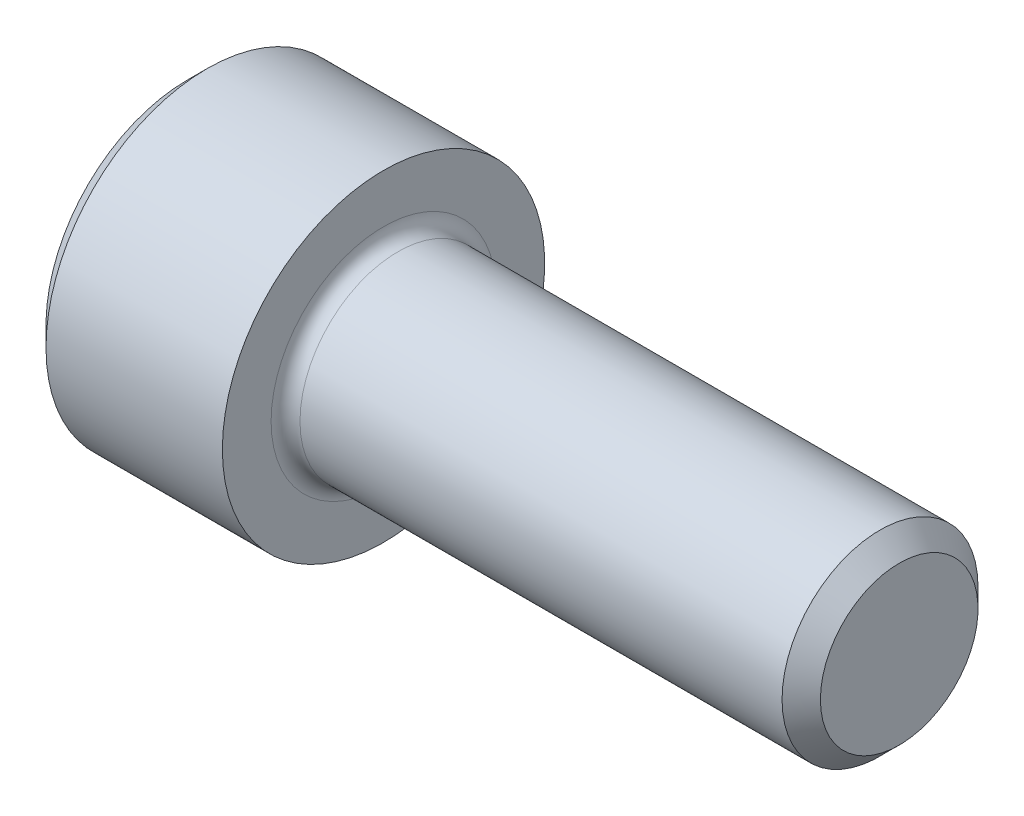
ISO-10303-21;
HEADER;
FILE_DESCRIPTION(('STEP AP214'),'2;1');
FILE_NAME('part.step','',(''),(''),'','','');
FILE_SCHEMA(('AUTOMOTIVE_DESIGN { 1 0 10303 214 1 1 1 1 }'));
ENDSEC;
DATA;
#1=APPLICATION_CONTEXT('core data for automotive mechanical design processes');
#2=APPLICATION_PROTOCOL_DEFINITION('international standard','automotive_design',2000,#1);
#3=PRODUCT_CONTEXT('',#1,'mechanical');
#4=PRODUCT('Part','Part','',(#3));
#5=PRODUCT_RELATED_PRODUCT_CATEGORY('part','',(#4));
#6=PRODUCT_DEFINITION_FORMATION('','',#4);
#7=PRODUCT_DEFINITION_CONTEXT('part definition',#1,'design');
#8=PRODUCT_DEFINITION('design','',#6,#7);
#9=PRODUCT_DEFINITION_SHAPE('','',#8);
#10=(LENGTH_UNIT() NAMED_UNIT(*) SI_UNIT(.MILLI.,.METRE.));
#11=(NAMED_UNIT(*) PLANE_ANGLE_UNIT() SI_UNIT($,.RADIAN.));
#12=(NAMED_UNIT(*) SI_UNIT($,.STERADIAN.) SOLID_ANGLE_UNIT());
#13=UNCERTAINTY_MEASURE_WITH_UNIT(LENGTH_MEASURE(1.E-05),#10,'distance_accuracy_value','');
#14=(GEOMETRIC_REPRESENTATION_CONTEXT(3) GLOBAL_UNCERTAINTY_ASSIGNED_CONTEXT((#13)) GLOBAL_UNIT_ASSIGNED_CONTEXT((#10,
#11,#12)) REPRESENTATION_CONTEXT('',''));
#15=CARTESIAN_POINT('',(0.,0.,0.));
#16=DIRECTION('',(0.,0.,1.));
#17=DIRECTION('',(1.,0.,0.));
#18=AXIS2_PLACEMENT_3D('',#15,#16,#17);
#19=CARTESIAN_POINT('',(2.286,1.14604605784411,1.98501));
#20=DIRECTION('',(-1.,0.,0.));
#21=DIRECTION('',(0.,0.,1.));
#22=AXIS2_PLACEMENT_3D('',#19,#20,#21);
#23=PLANE('',#22);
#24=DIRECTION('',(0.,0.500000000000001,0.866025403784438));
#25=VECTOR('',#24,1.);
#26=CARTESIAN_POINT('',(2.286,-1.71906908676614,0.992505));
#27=LINE('',#26,#25);
#28=CARTESIAN_POINT('',(2.2859999999804,-1.71906908679011,0.992505000013839));
#29=VERTEX_POINT('',#28);
#30=CARTESIAN_POINT('',(2.286,-1.14604605784409,1.98501));
#31=VERTEX_POINT('',#30);
#32=EDGE_CURVE('E98',#29,#31,#27,.T.);
#33=ORIENTED_EDGE('',*,*,#32,.T.);
#34=DIRECTION('',(0.,1.,0.));
#35=VECTOR('',#34,1.);
#36=CARTESIAN_POINT('',(2.286,1.14604605784411,1.98501));
#37=LINE('',#36,#35);
#38=CARTESIAN_POINT('',(2.28599999998701,0.,1.98501000001309));
#39=VERTEX_POINT('',#38);
#40=EDGE_CURVE('E93',#31,#39,#37,.T.);
#41=ORIENTED_EDGE('',*,*,#40,.T.);
#42=CARTESIAN_POINT('',(2.2859999999608,0.,0.));
#43=DIRECTION('',(-1.,0.,0.));
#44=DIRECTION('',(0.,0.,1.));
#45=AXIS2_PLACEMENT_3D('',#42,#43,#44);
#46=CIRCLE('',#45,1.98501000005535);
#47=EDGE_CURVE('E95',#39,#29,#46,.F.);
#48=ORIENTED_EDGE('',*,*,#47,.T.);
#49=EDGE_LOOP('',(#33,#41,#48));
#50=FACE_BOUND('',#49,.T.);
#51=ADVANCED_FACE('F14',(#50),#23,.T.);
#52=CARTESIAN_POINT('',(2.286,1.14604605784411,1.98501));
#53=DIRECTION('',(-1.,0.,0.));
#54=DIRECTION('',(0.,0.,1.));
#55=AXIS2_PLACEMENT_3D('',#52,#53,#54);
#56=PLANE('',#55);
#57=DIRECTION('',(0.,-0.499999999999998,0.86602540378444));
#58=VECTOR('',#57,1.);
#59=CARTESIAN_POINT('',(2.286,-1.71906908676615,-0.992504999999996));
#60=LINE('',#59,#58);
#61=CARTESIAN_POINT('',(2.2859999999804,-1.71906908679012,-0.992505000013836));
#62=VERTEX_POINT('',#61);
#63=CARTESIAN_POINT('',(2.286,-2.29209211568819,0.));
#64=VERTEX_POINT('',#63);
#65=EDGE_CURVE('E102',#62,#64,#60,.T.);
#66=ORIENTED_EDGE('',*,*,#65,.T.);
#67=DIRECTION('',(0.,0.500000000000001,0.866025403784438));
#68=VECTOR('',#67,1.);
#69=CARTESIAN_POINT('',(2.286,-2.29209211568819,0.));
#70=LINE('',#69,#68);
#71=EDGE_CURVE('E153',#64,#29,#70,.T.);
#72=ORIENTED_EDGE('',*,*,#71,.T.);
#73=CARTESIAN_POINT('',(2.2859999999608,0.,0.));
#74=DIRECTION('',(-1.,0.,0.));
#75=DIRECTION('',(0.,0.,1.));
#76=AXIS2_PLACEMENT_3D('',#73,#74,#75);
#77=CIRCLE('',#76,1.98501000005535);
#78=EDGE_CURVE('E114',#29,#62,#77,.F.);
#79=ORIENTED_EDGE('',*,*,#78,.T.);
#80=EDGE_LOOP('',(#66,#72,#79));
#81=FACE_BOUND('',#80,.T.);
#82=ADVANCED_FACE('F309',(#81),#56,.T.);
#83=CARTESIAN_POINT('',(2.286,1.14604605784411,1.98501));
#84=DIRECTION('',(-1.,0.,0.));
#85=DIRECTION('',(0.,0.,1.));
#86=AXIS2_PLACEMENT_3D('',#83,#84,#85);
#87=PLANE('',#86);
#88=DIRECTION('',(0.,1.,0.));
#89=VECTOR('',#88,1.);
#90=CARTESIAN_POINT('',(2.286,1.14604605784411,-1.98501));
#91=LINE('',#90,#89);
#92=CARTESIAN_POINT('',(2.28599999998701,0.,-1.98501000001309));
#93=VERTEX_POINT('',#92);
#94=CARTESIAN_POINT('',(2.286,-1.1460460578441,-1.98501));
#95=VERTEX_POINT('',#94);
#96=EDGE_CURVE('E150',#93,#95,#91,.F.);
#97=ORIENTED_EDGE('',*,*,#96,.T.);
#98=DIRECTION('',(0.,-0.499999999999999,0.866025403784439));
#99=VECTOR('',#98,1.);
#100=CARTESIAN_POINT('',(2.286,-1.1460460578441,-1.98501));
#101=LINE('',#100,#99);
#102=EDGE_CURVE('E147',#95,#62,#101,.T.);
#103=ORIENTED_EDGE('',*,*,#102,.T.);
#104=CARTESIAN_POINT('',(2.2859999999608,0.,0.));
#105=DIRECTION('',(-1.,0.,0.));
#106=DIRECTION('',(0.,0.,1.));
#107=AXIS2_PLACEMENT_3D('',#104,#105,#106);
#108=CIRCLE('',#107,1.98501000005535);
#109=EDGE_CURVE('E186',#62,#93,#108,.F.);
#110=ORIENTED_EDGE('',*,*,#109,.T.);
#111=EDGE_LOOP('',(#97,#103,#110));
#112=FACE_BOUND('',#111,.T.);
#113=ADVANCED_FACE('F306',(#112),#87,.T.);
#114=CARTESIAN_POINT('',(2.286,1.14604605784411,1.98501));
#115=DIRECTION('',(-1.,0.,0.));
#116=DIRECTION('',(0.,0.,1.));
#117=AXIS2_PLACEMENT_3D('',#114,#115,#116);
#118=PLANE('',#117);
#119=DIRECTION('',(0.,-0.500000000000001,-0.866025403784438));
#120=VECTOR('',#119,1.);
#121=CARTESIAN_POINT('',(2.286,1.71906908676615,-0.992505000000006));
#122=LINE('',#121,#120);
#123=CARTESIAN_POINT('',(2.2859999999804,1.71906908679012,-0.992505000013843));
#124=VERTEX_POINT('',#123);
#125=CARTESIAN_POINT('',(2.286,1.1460460578441,-1.98501));
#126=VERTEX_POINT('',#125);
#127=EDGE_CURVE('E144',#124,#126,#122,.T.);
#128=ORIENTED_EDGE('',*,*,#127,.T.);
#129=DIRECTION('',(0.,1.,0.));
#130=VECTOR('',#129,1.);
#131=CARTESIAN_POINT('',(2.286,1.14604605784411,-1.98501));
#132=LINE('',#131,#130);
#133=EDGE_CURVE('E141',#126,#93,#132,.F.);
#134=ORIENTED_EDGE('',*,*,#133,.T.);
#135=CARTESIAN_POINT('',(2.2859999999608,0.,0.));
#136=DIRECTION('',(-1.,0.,0.));
#137=DIRECTION('',(0.,0.,1.));
#138=AXIS2_PLACEMENT_3D('',#135,#136,#137);
#139=CIRCLE('',#138,1.98501000005535);
#140=EDGE_CURVE('E183',#93,#124,#139,.F.);
#141=ORIENTED_EDGE('',*,*,#140,.T.);
#142=EDGE_LOOP('',(#128,#134,#141));
#143=FACE_BOUND('',#142,.T.);
#144=ADVANCED_FACE('F302',(#143),#118,.T.);
#145=CARTESIAN_POINT('',(2.286,1.14604605784411,1.98501));
#146=DIRECTION('',(-1.,0.,0.));
#147=DIRECTION('',(0.,0.,1.));
#148=AXIS2_PLACEMENT_3D('',#145,#146,#147);
#149=PLANE('',#148);
#150=DIRECTION('',(0.,0.500000000000002,-0.866025403784437));
#151=VECTOR('',#150,1.);
#152=CARTESIAN_POINT('',(2.286,1.71906908676615,0.992504999999996));
#153=LINE('',#152,#151);
#154=CARTESIAN_POINT('',(2.2859999999804,1.71906908679012,0.992505000013835));
#155=VERTEX_POINT('',#154);
#156=CARTESIAN_POINT('',(2.286,2.2920921156882,0.));
#157=VERTEX_POINT('',#156);
#158=EDGE_CURVE('E138',#155,#157,#153,.T.);
#159=ORIENTED_EDGE('',*,*,#158,.T.);
#160=DIRECTION('',(0.,-0.500000000000002,-0.866025403784437));
#161=VECTOR('',#160,1.);
#162=CARTESIAN_POINT('',(2.286,2.2920921156882,0.));
#163=LINE('',#162,#161);
#164=EDGE_CURVE('E115',#157,#124,#163,.T.);
#165=ORIENTED_EDGE('',*,*,#164,.T.);
#166=CARTESIAN_POINT('',(2.2859999999608,0.,0.));
#167=DIRECTION('',(-1.,0.,0.));
#168=DIRECTION('',(0.,0.,1.));
#169=AXIS2_PLACEMENT_3D('',#166,#167,#168);
#170=CIRCLE('',#169,1.98501000005535);
#171=EDGE_CURVE('E122',#124,#155,#170,.F.);
#172=ORIENTED_EDGE('',*,*,#171,.T.);
#173=EDGE_LOOP('',(#159,#165,#172));
#174=FACE_BOUND('',#173,.T.);
#175=ADVANCED_FACE('F298',(#174),#149,.T.);
#176=CARTESIAN_POINT('',(2.28600000002643,0.,0.));
#177=DIRECTION('',(-1.,0.,0.));
#178=DIRECTION('',(0.,0.,1.));
#179=AXIS2_PLACEMENT_3D('',#176,#177,#178);
#180=CONICAL_SURFACE('',#179,1.98500999994167,1.04719755112655);
#181=CARTESIAN_POINT('',(3.43204605781011,0.,5.6843418860808E-11));
#182=VERTEX_POINT('',#181);
#183=VERTEX_LOOP('',#182);
#184=FACE_BOUND('',#183,.T.);
#185=ORIENTED_EDGE('',*,*,#47,.F.);
#186=CARTESIAN_POINT('',(2.2859999999608,0.,0.));
#187=DIRECTION('',(-1.,0.,0.));
#188=DIRECTION('',(0.,0.,1.));
#189=AXIS2_PLACEMENT_3D('',#186,#187,#188);
#190=CIRCLE('',#189,1.98501000005535);
#191=EDGE_CURVE('E110',#155,#39,#190,.F.);
#192=ORIENTED_EDGE('',*,*,#191,.F.);
#193=ORIENTED_EDGE('',*,*,#171,.F.);
#194=ORIENTED_EDGE('',*,*,#140,.F.);
#195=ORIENTED_EDGE('',*,*,#109,.F.);
#196=ORIENTED_EDGE('',*,*,#78,.F.);
#197=EDGE_LOOP('',(#185,#192,#193,#194,#195,#196));
#198=FACE_BOUND('',#197,.T.);
#199=ADVANCED_FACE('F108',(#184,#198),#180,.F.);
#200=CARTESIAN_POINT('',(2.286,1.14604605784411,1.98501));
#201=DIRECTION('',(-1.,0.,0.));
#202=DIRECTION('',(0.,0.,1.));
#203=AXIS2_PLACEMENT_3D('',#200,#201,#202);
#204=PLANE('',#203);
#205=DIRECTION('',(0.,-1.,0.));
#206=VECTOR('',#205,1.);
#207=CARTESIAN_POINT('',(2.286,-1.14604605784409,1.98501));
#208=LINE('',#207,#206);
#209=CARTESIAN_POINT('',(2.286,1.14604605784411,1.98501));
#210=VERTEX_POINT('',#209);
#211=EDGE_CURVE('E119',#39,#210,#208,.F.);
#212=ORIENTED_EDGE('',*,*,#211,.T.);
#213=DIRECTION('',(0.,0.499999999999998,-0.86602540378444));
#214=VECTOR('',#213,1.);
#215=CARTESIAN_POINT('',(2.286,2.2920921156882,0.));
#216=LINE('',#215,#214);
#217=EDGE_CURVE('E121',#155,#210,#216,.F.);
#218=ORIENTED_EDGE('',*,*,#217,.F.);
#219=ORIENTED_EDGE('',*,*,#191,.T.);
#220=EDGE_LOOP('',(#212,#218,#219));
#221=FACE_BOUND('',#220,.T.);
#222=ADVANCED_FACE('F118',(#221),#204,.T.);
#223=CARTESIAN_POINT('',(2.286,2.2920921156882,0.));
#224=DIRECTION('',(0.,-0.86602540378444,-0.499999999999998));
#225=DIRECTION('',(0.,0.499999999999998,-0.86602540378444));
#226=AXIS2_PLACEMENT_3D('',#223,#224,#225);
#227=PLANE('',#226);
#228=ORIENTED_EDGE('',*,*,#217,.T.);
#229=DIRECTION('',(1.,0.,0.));
#230=VECTOR('',#229,1.);
#231=CARTESIAN_POINT('',(2.286,1.14604605784411,1.98501));
#232=LINE('',#231,#230);
#233=CARTESIAN_POINT('',(0.,1.14604605784411,1.98501));
#234=VERTEX_POINT('',#233);
#235=EDGE_CURVE('E127',#210,#234,#232,.F.);
#236=ORIENTED_EDGE('',*,*,#235,.T.);
#237=DIRECTION('',(0.,-0.499999999999998,0.86602540378444));
#238=VECTOR('',#237,1.);
#239=CARTESIAN_POINT('',(0.,2.2920921156882,0.));
#240=LINE('',#239,#238);
#241=CARTESIAN_POINT('',(0.,2.2920921156882,0.));
#242=VERTEX_POINT('',#241);
#243=EDGE_CURVE('E133',#242,#234,#240,.T.);
#244=ORIENTED_EDGE('',*,*,#243,.F.);
#245=DIRECTION('',(1.,0.,0.));
#246=VECTOR('',#245,1.);
#247=CARTESIAN_POINT('',(2.286,2.2920921156882,0.));
#248=LINE('',#247,#246);
#249=EDGE_CURVE('E158',#242,#157,#248,.T.);
#250=ORIENTED_EDGE('',*,*,#249,.T.);
#251=ORIENTED_EDGE('',*,*,#158,.F.);
#252=EDGE_LOOP('',(#228,#236,#244,#250,#251));
#253=FACE_BOUND('',#252,.T.);
#254=ADVANCED_FACE('F290',(#253),#227,.T.);
#255=CARTESIAN_POINT('',(2.286,-1.14604605784409,1.98501));
#256=DIRECTION('',(0.,0.,1.));
#257=DIRECTION('',(0.,-1.,0.));
#258=AXIS2_PLACEMENT_3D('',#255,#256,#257);
#259=PLANE('',#258);
#260=ORIENTED_EDGE('',*,*,#235,.F.);
#261=ORIENTED_EDGE('',*,*,#211,.F.);
#262=ORIENTED_EDGE('',*,*,#40,.F.);
#263=DIRECTION('',(1.,0.,0.));
#264=VECTOR('',#263,1.);
#265=CARTESIAN_POINT('',(2.286,-1.14604605784409,1.98501));
#266=LINE('',#265,#264);
#267=CARTESIAN_POINT('',(0.,-1.14604605784409,1.98501));
#268=VERTEX_POINT('',#267);
#269=EDGE_CURVE('E129',#268,#31,#266,.T.);
#270=ORIENTED_EDGE('',*,*,#269,.F.);
#271=DIRECTION('',(0.,1.,0.));
#272=VECTOR('',#271,1.);
#273=CARTESIAN_POINT('',(0.,0.,1.98501));
#274=LINE('',#273,#272);
#275=EDGE_CURVE('E325',#234,#268,#274,.F.);
#276=ORIENTED_EDGE('',*,*,#275,.F.);
#277=EDGE_LOOP('',(#260,#261,#262,#270,#276));
#278=FACE_BOUND('',#277,.T.);
#279=ADVANCED_FACE('F125',(#278),#259,.F.);
#280=CARTESIAN_POINT('',(2.286,-1.14604605784409,1.98501));
#281=DIRECTION('',(0.,0.866025403784438,-0.500000000000001));
#282=DIRECTION('',(0.,0.500000000000001,0.866025403784438));
#283=AXIS2_PLACEMENT_3D('',#280,#281,#282);
#284=PLANE('',#283);
#285=ORIENTED_EDGE('',*,*,#71,.F.);
#286=DIRECTION('',(1.,0.,0.));
#287=VECTOR('',#286,1.);
#288=CARTESIAN_POINT('',(2.286,-2.29209211568819,0.));
#289=LINE('',#288,#287);
#290=CARTESIAN_POINT('',(0.,-2.29209211568819,0.));
#291=VERTEX_POINT('',#290);
#292=EDGE_CURVE('E165',#291,#64,#289,.T.);
#293=ORIENTED_EDGE('',*,*,#292,.F.);
#294=DIRECTION('',(0.,-0.500000000000001,-0.866025403784438));
#295=VECTOR('',#294,1.);
#296=CARTESIAN_POINT('',(0.,-1.14604605784409,1.98501));
#297=LINE('',#296,#295);
#298=EDGE_CURVE('E323',#268,#291,#297,.T.);
#299=ORIENTED_EDGE('',*,*,#298,.F.);
#300=ORIENTED_EDGE('',*,*,#269,.T.);
#301=ORIENTED_EDGE('',*,*,#32,.F.);
#302=EDGE_LOOP('',(#285,#293,#299,#300,#301));
#303=FACE_BOUND('',#302,.T.);
#304=ADVANCED_FACE('F283',(#303),#284,.T.);
#305=CARTESIAN_POINT('',(2.286,-2.29209211568819,0.));
#306=DIRECTION('',(0.,0.866025403784439,0.499999999999999));
#307=DIRECTION('',(0.,-0.499999999999999,0.866025403784439));
#308=AXIS2_PLACEMENT_3D('',#305,#306,#307);
#309=PLANE('',#308);
#310=ORIENTED_EDGE('',*,*,#102,.F.);
#311=DIRECTION('',(1.,0.,0.));
#312=VECTOR('',#311,1.);
#313=CARTESIAN_POINT('',(2.286,-1.1460460578441,-1.98501));
#314=LINE('',#313,#312);
#315=CARTESIAN_POINT('',(0.,-1.1460460578441,-1.98501));
#316=VERTEX_POINT('',#315);
#317=EDGE_CURVE('E162',#95,#316,#314,.F.);
#318=ORIENTED_EDGE('',*,*,#317,.T.);
#319=DIRECTION('',(0.,0.499999999999999,-0.86602540378444));
#320=VECTOR('',#319,1.);
#321=CARTESIAN_POINT('',(0.,-2.29209211568819,0.));
#322=LINE('',#321,#320);
#323=EDGE_CURVE('E320',#291,#316,#322,.T.);
#324=ORIENTED_EDGE('',*,*,#323,.F.);
#325=ORIENTED_EDGE('',*,*,#292,.T.);
#326=ORIENTED_EDGE('',*,*,#65,.F.);
#327=EDGE_LOOP('',(#310,#318,#324,#325,#326));
#328=FACE_BOUND('',#327,.T.);
#329=ADVANCED_FACE('F279',(#328),#309,.T.);
#330=CARTESIAN_POINT('',(2.286,1.1460460578441,-1.98501));
#331=DIRECTION('',(0.,0.,-1.));
#332=DIRECTION('',(0.,1.,0.));
#333=AXIS2_PLACEMENT_3D('',#330,#331,#332);
#334=PLANE('',#333);
#335=ORIENTED_EDGE('',*,*,#317,.F.);
#336=ORIENTED_EDGE('',*,*,#96,.F.);
#337=ORIENTED_EDGE('',*,*,#133,.F.);
#338=DIRECTION('',(1.,0.,0.));
#339=VECTOR('',#338,1.);
#340=CARTESIAN_POINT('',(2.286,1.1460460578441,-1.98501));
#341=LINE('',#340,#339);
#342=CARTESIAN_POINT('',(0.,1.1460460578441,-1.98501));
#343=VERTEX_POINT('',#342);
#344=EDGE_CURVE('E161',#126,#343,#341,.F.);
#345=ORIENTED_EDGE('',*,*,#344,.T.);
#346=DIRECTION('',(0.,1.,0.));
#347=VECTOR('',#346,1.);
#348=CARTESIAN_POINT('',(0.,0.,-1.98501));
#349=LINE('',#348,#347);
#350=EDGE_CURVE('E335',#316,#343,#349,.T.);
#351=ORIENTED_EDGE('',*,*,#350,.F.);
#352=EDGE_LOOP('',(#335,#336,#337,#345,#351));
#353=FACE_BOUND('',#352,.T.);
#354=ADVANCED_FACE('F275',(#353),#334,.F.);
#355=CARTESIAN_POINT('',(2.286,2.2920921156882,0.));
#356=DIRECTION('',(0.,0.866025403784438,-0.500000000000002));
#357=DIRECTION('',(0.,0.500000000000002,0.866025403784438));
#358=AXIS2_PLACEMENT_3D('',#355,#356,#357);
#359=PLANE('',#358);
#360=ORIENTED_EDGE('',*,*,#344,.F.);
#361=ORIENTED_EDGE('',*,*,#127,.F.);
#362=ORIENTED_EDGE('',*,*,#164,.F.);
#363=ORIENTED_EDGE('',*,*,#249,.F.);
#364=DIRECTION('',(0.,0.500000000000002,0.866025403784438));
#365=VECTOR('',#364,1.);
#366=CARTESIAN_POINT('',(0.,1.1460460578441,-1.98501));
#367=LINE('',#366,#365);
#368=EDGE_CURVE('E179',#343,#242,#367,.T.);
#369=ORIENTED_EDGE('',*,*,#368,.F.);
#370=EDGE_LOOP('',(#360,#361,#362,#363,#369));
#371=FACE_BOUND('',#370,.T.);
#372=ADVANCED_FACE('F271',(#371),#359,.F.);
#373=CARTESIAN_POINT('',(0.,0.,0.));
#374=DIRECTION('',(-1.,0.,0.));
#375=DIRECTION('',(0.,0.,1.));
#376=AXIS2_PLACEMENT_3D('',#373,#374,#375);
#377=PLANE('',#376);
#378=CARTESIAN_POINT('',(-5.6843418860808E-11,0.,0.));
#379=DIRECTION('',(1.,0.,0.));
#380=DIRECTION('',(0.,1.,0.));
#381=AXIS2_PLACEMENT_3D('',#378,#379,#380);
#382=CIRCLE('',#381,3.48615000001473);
#383=CARTESIAN_POINT('',(-5.68434426698877E-11,3.48615000001473,0.));
#384=VERTEX_POINT('',#383);
#385=EDGE_CURVE('E177',#384,#384,#382,.T.);
#386=ORIENTED_EDGE('',*,*,#385,.F.);
#387=EDGE_LOOP('',(#386));
#388=FACE_BOUND('',#387,.T.);
#389=ORIENTED_EDGE('',*,*,#350,.T.);
#390=ORIENTED_EDGE('',*,*,#368,.T.);
#391=ORIENTED_EDGE('',*,*,#243,.T.);
#392=ORIENTED_EDGE('',*,*,#275,.T.);
#393=ORIENTED_EDGE('',*,*,#298,.T.);
#394=ORIENTED_EDGE('',*,*,#323,.T.);
#395=EDGE_LOOP('',(#389,#390,#391,#392,#393,#394));
#396=FACE_BOUND('',#395,.T.);
#397=ADVANCED_FACE('F263',(#388,#396),#377,.T.);
#398=CARTESIAN_POINT('',(0.482599999998001,0.,0.));
#399=DIRECTION('',(1.,0.,0.));
#400=DIRECTION('',(0.,1.,0.));
#401=AXIS2_PLACEMENT_3D('',#398,#399,#400);
#402=CONICAL_SURFACE('',#401,3.96875000006958,0.785398163397448);
#403=ORIENTED_EDGE('',*,*,#385,.T.);
#404=EDGE_LOOP('',(#403));
#405=FACE_BOUND('',#404,.T.);
#406=CARTESIAN_POINT('',(0.4826,0.,0.));
#407=DIRECTION('',(-1.,0.,0.));
#408=DIRECTION('',(0.,0.,1.));
#409=AXIS2_PLACEMENT_3D('',#406,#407,#408);
#410=CIRCLE('',#409,3.96875);
#411=CARTESIAN_POINT('',(0.4826,0.,3.96875));
#412=VERTEX_POINT('',#411);
#413=EDGE_CURVE('E176',#412,#412,#410,.F.);
#414=ORIENTED_EDGE('',*,*,#413,.F.);
#415=EDGE_LOOP('',(#414));
#416=FACE_BOUND('',#415,.T.);
#417=ADVANCED_FACE('F258',(#405,#416),#402,.T.);
#418=CARTESIAN_POINT('',(-31.75,0.,0.));
#419=DIRECTION('',(-1.,0.,0.));
#420=DIRECTION('',(0.,0.,1.));
#421=AXIS2_PLACEMENT_3D('',#418,#419,#420);
#422=CYLINDRICAL_SURFACE('',#421,3.96875);
#423=CARTESIAN_POINT('',(4.826,0.,0.));
#424=DIRECTION('',(-1.,0.,0.));
#425=DIRECTION('',(0.,0.,1.));
#426=AXIS2_PLACEMENT_3D('',#423,#424,#425);
#427=CIRCLE('',#426,3.96875);
#428=CARTESIAN_POINT('',(4.826,0.,3.96875));
#429=VERTEX_POINT('',#428);
#430=EDGE_CURVE('E173',#429,#429,#427,.F.);
#431=ORIENTED_EDGE('',*,*,#430,.F.);
#432=EDGE_LOOP('',(#431));
#433=FACE_BOUND('',#432,.T.);
#434=ORIENTED_EDGE('',*,*,#413,.T.);
#435=EDGE_LOOP('',(#434));
#436=FACE_BOUND('',#435,.T.);
#437=ADVANCED_FACE('F254',(#433,#436),#422,.T.);
#438=CARTESIAN_POINT('',(17.526,1.94056,0.));
#439=DIRECTION('',(1.,0.,0.));
#440=DIRECTION('',(0.,0.,-1.));
#441=AXIS2_PLACEMENT_3D('',#438,#439,#440);
#442=PLANE('',#441);
#443=CARTESIAN_POINT('',(17.5259999999753,0.,0.));
#444=DIRECTION('',(-1.,0.,0.));
#445=DIRECTION('',(0.,0.,1.));
#446=AXIS2_PLACEMENT_3D('',#443,#444,#445);
#447=CIRCLE('',#446,1.94055999998);
#448=CARTESIAN_POINT('',(17.5259999999753,0.,1.94055999998));
#449=VERTEX_POINT('',#448);
#450=EDGE_CURVE('E169',#449,#449,#447,.T.);
#451=ORIENTED_EDGE('',*,*,#450,.F.);
#452=EDGE_LOOP('',(#451));
#453=FACE_BOUND('',#452,.T.);
#454=ADVANCED_FACE('F212',(#453),#442,.T.);
#455=CARTESIAN_POINT('',(4.826,3.96875,0.));
#456=DIRECTION('',(1.,0.,0.));
#457=DIRECTION('',(0.,0.,-1.));
#458=AXIS2_PLACEMENT_3D('',#455,#456,#457);
#459=PLANE('',#458);
#460=ORIENTED_EDGE('',*,*,#430,.T.);
#461=EDGE_LOOP('',(#460));
#462=FACE_BOUND('',#461,.T.);
#463=CARTESIAN_POINT('',(4.826,0.,0.));
#464=DIRECTION('',(1.,0.,0.));
#465=DIRECTION('',(0.,0.,1.));
#466=AXIS2_PLACEMENT_3D('',#463,#464,#465);
#467=CIRCLE('',#466,2.76859999999999);
#468=CARTESIAN_POINT('',(4.826,0.,-2.76859999999999));
#469=VERTEX_POINT('',#468);
#470=CARTESIAN_POINT('',(4.826,0.,2.76859999999999));
#471=VERTEX_POINT('',#470);
#472=EDGE_CURVE('E172',#469,#471,#467,.F.);
#473=ORIENTED_EDGE('',*,*,#472,.T.);
#474=CARTESIAN_POINT('',(4.826,0.,0.));
#475=DIRECTION('',(1.,0.,0.));
#476=DIRECTION('',(0.,0.,-1.));
#477=AXIS2_PLACEMENT_3D('',#474,#475,#476);
#478=CIRCLE('',#477,2.76859999999999);
#479=EDGE_CURVE('E33',#471,#469,#478,.F.);
#480=ORIENTED_EDGE('',*,*,#479,.T.);
#481=EDGE_LOOP('',(#473,#480));
#482=FACE_BOUND('',#481,.T.);
#483=ADVANCED_FACE('F193',(#462,#482),#459,.T.);
#484=CARTESIAN_POINT('',(17.0535599999084,0.,0.));
#485=DIRECTION('',(-1.,0.,0.));
#486=DIRECTION('',(0.,0.,1.));
#487=AXIS2_PLACEMENT_3D('',#484,#485,#486);
#488=CONICAL_SURFACE('',#487,2.41299999999001,0.785398163337289);
#489=CARTESIAN_POINT('',(17.05356,0.,0.));
#490=DIRECTION('',(-1.,0.,0.));
#491=DIRECTION('',(0.,0.,1.));
#492=AXIS2_PLACEMENT_3D('',#489,#490,#491);
#493=CIRCLE('',#492,2.41299999999999);
#494=CARTESIAN_POINT('',(17.05356,0.,2.41299999999999));
#495=VERTEX_POINT('',#494);
#496=EDGE_CURVE('E25',#495,#495,#493,.T.);
#497=ORIENTED_EDGE('',*,*,#496,.F.);
#498=EDGE_LOOP('',(#497));
#499=FACE_BOUND('',#498,.T.);
#500=ORIENTED_EDGE('',*,*,#450,.T.);
#501=EDGE_LOOP('',(#500));
#502=FACE_BOUND('',#501,.T.);
#503=ADVANCED_FACE('F211',(#499,#502),#488,.T.);
#504=CARTESIAN_POINT('',(5.1816,0.,0.));
#505=DIRECTION('',(1.,0.,0.));
#506=DIRECTION('',(0.,0.,-1.));
#507=AXIS2_PLACEMENT_3D('',#504,#505,#506);
#508=TOROIDAL_SURFACE('',#507,2.76859999999999,0.3556);
#509=CARTESIAN_POINT('',(5.1816,0.,0.));
#510=DIRECTION('',(-1.,0.,0.));
#511=DIRECTION('',(0.,0.,1.));
#512=AXIS2_PLACEMENT_3D('',#509,#510,#511);
#513=CIRCLE('',#512,2.41299999999999);
#514=CARTESIAN_POINT('',(5.1816,0.,2.41299999999999));
#515=VERTEX_POINT('',#514);
#516=EDGE_CURVE('E9',#515,#515,#513,.F.);
#517=ORIENTED_EDGE('',*,*,#516,.F.);
#518=EDGE_LOOP('',(#517));
#519=FACE_BOUND('',#518,.T.);
#520=ORIENTED_EDGE('',*,*,#472,.F.);
#521=ORIENTED_EDGE('',*,*,#479,.F.);
#522=EDGE_LOOP('',(#520,#521));
#523=FACE_BOUND('',#522,.T.);
#524=ADVANCED_FACE('F190',(#519,#523),#508,.F.);
#525=CARTESIAN_POINT('',(-31.75,0.,0.));
#526=DIRECTION('',(-1.,0.,0.));
#527=DIRECTION('',(0.,0.,1.));
#528=AXIS2_PLACEMENT_3D('',#525,#526,#527);
#529=CYLINDRICAL_SURFACE('',#528,2.41299999999999);
#530=ORIENTED_EDGE('',*,*,#516,.T.);
#531=EDGE_LOOP('',(#530));
#532=FACE_BOUND('',#531,.T.);
#533=ORIENTED_EDGE('',*,*,#496,.T.);
#534=EDGE_LOOP('',(#533));
#535=FACE_BOUND('',#534,.T.);
#536=ADVANCED_FACE('F236',(#532,#535),#529,.T.);
#537=CLOSED_SHELL('',(#51,#82,#113,#144,#175,#199,#222,#254,#279,#304,#329,#354,#372,#397,#417,
#437,#454,#483,#503,#524,#536));
#538=MANIFOLD_SOLID_BREP('B1',#537);
#539=ADVANCED_BREP_SHAPE_REPRESENTATION('',(#18,#538),#14);
#540=SHAPE_DEFINITION_REPRESENTATION(#9,#539);
ENDSEC;
END-ISO-10303-21;
